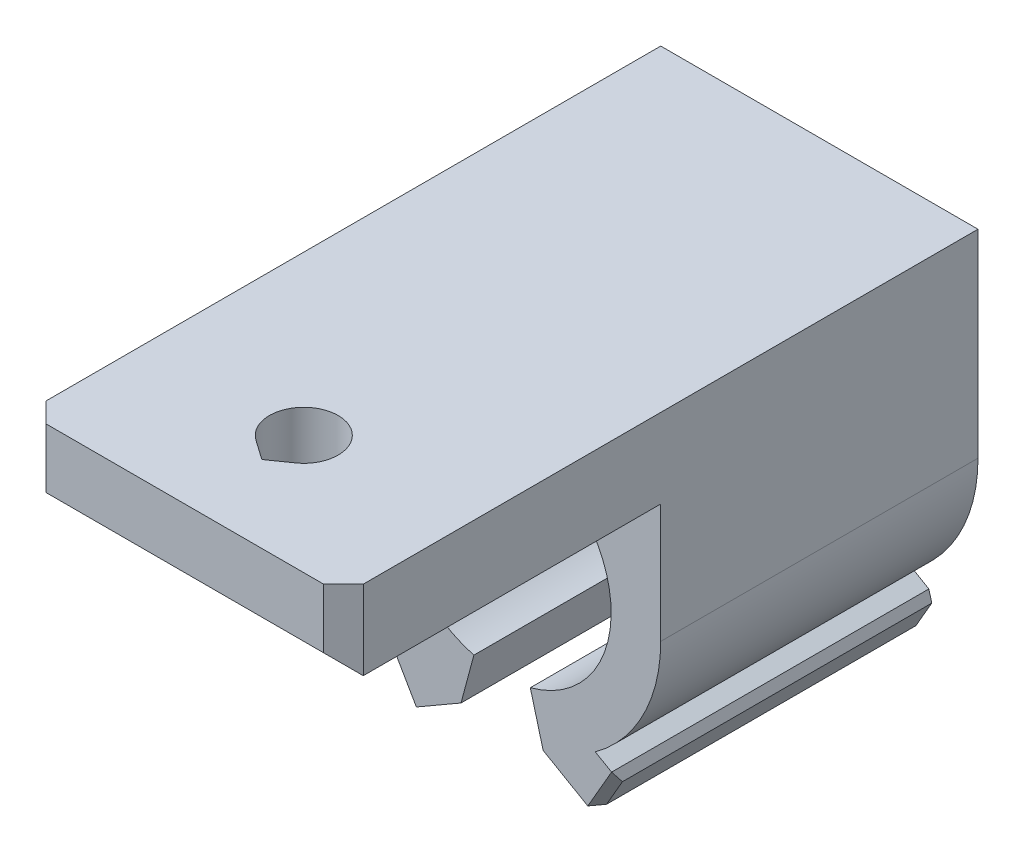
ISO-10303-21;
HEADER;
FILE_DESCRIPTION(('STEP AP214'),'2;1');
FILE_NAME('part.step','',(''),(''),'','','');
FILE_SCHEMA(('AUTOMOTIVE_DESIGN { 1 0 10303 214 1 1 1 1 }'));
ENDSEC;
DATA;
#1=APPLICATION_CONTEXT('core data for automotive mechanical design processes');
#2=APPLICATION_PROTOCOL_DEFINITION('international standard','automotive_design',2000,#1);
#3=PRODUCT_CONTEXT('',#1,'mechanical');
#4=PRODUCT('Part','Part','',(#3));
#5=PRODUCT_RELATED_PRODUCT_CATEGORY('part','',(#4));
#6=PRODUCT_DEFINITION_FORMATION('','',#4);
#7=PRODUCT_DEFINITION_CONTEXT('part definition',#1,'design');
#8=PRODUCT_DEFINITION('design','',#6,#7);
#9=PRODUCT_DEFINITION_SHAPE('','',#8);
#10=(LENGTH_UNIT() NAMED_UNIT(*) SI_UNIT(.MILLI.,.METRE.));
#11=(NAMED_UNIT(*) PLANE_ANGLE_UNIT() SI_UNIT($,.RADIAN.));
#12=(NAMED_UNIT(*) SI_UNIT($,.STERADIAN.) SOLID_ANGLE_UNIT());
#13=UNCERTAINTY_MEASURE_WITH_UNIT(LENGTH_MEASURE(1.E-05),#10,'distance_accuracy_value','');
#14=(GEOMETRIC_REPRESENTATION_CONTEXT(3) GLOBAL_UNCERTAINTY_ASSIGNED_CONTEXT((#13)) GLOBAL_UNIT_ASSIGNED_CONTEXT((#10,
#11,#12)) REPRESENTATION_CONTEXT('',''));
#15=CARTESIAN_POINT('',(0.,0.,0.));
#16=DIRECTION('',(0.,0.,1.));
#17=DIRECTION('',(1.,0.,0.));
#18=AXIS2_PLACEMENT_3D('',#15,#16,#17);
#19=CARTESIAN_POINT('',(0.,12.7,33.02));
#20=DIRECTION('',(0.,-1.,0.));
#21=DIRECTION('',(1.,0.,0.));
#22=AXIS2_PLACEMENT_3D('',#19,#20,#21);
#23=CYLINDRICAL_SURFACE('',#22,2.2);
#24=CARTESIAN_POINT('',(0.,9.01700000000003,33.02));
#25=DIRECTION('',(0.,-1.,0.));
#26=DIRECTION('',(1.,0.,0.));
#27=AXIS2_PLACEMENT_3D('',#24,#25,#26);
#28=CIRCLE('',#27,2.2);
#29=CARTESIAN_POINT('',(-1.26186815997234,9.01700000000003,34.8221344974358));
#30=VERTEX_POINT('',#29);
#31=CARTESIAN_POINT('',(1.26186815997228,9.01700000000004,34.8221344974358));
#32=VERTEX_POINT('',#31);
#33=EDGE_CURVE('E241',#30,#32,#28,.T.);
#34=ORIENTED_EDGE('',*,*,#33,.T.);
#35=DIRECTION('',(0.,-1.,0.));
#36=VECTOR('',#35,1.);
#37=CARTESIAN_POINT('',(1.26186815997227,12.7,34.8221344974358));
#38=LINE('',#37,#36);
#39=CARTESIAN_POINT('',(1.26186815997227,12.7,34.8221344974358));
#40=VERTEX_POINT('',#39);
#41=EDGE_CURVE('E252',#40,#32,#38,.T.);
#42=ORIENTED_EDGE('',*,*,#41,.F.);
#43=CARTESIAN_POINT('',(0.,12.7,33.02));
#44=DIRECTION('',(0.,-1.,0.));
#45=DIRECTION('',(1.,0.,0.));
#46=AXIS2_PLACEMENT_3D('',#43,#44,#45);
#47=CIRCLE('',#46,2.2);
#48=CARTESIAN_POINT('',(-1.26186815997235,12.7,34.8221344974358));
#49=VERTEX_POINT('',#48);
#50=EDGE_CURVE('E948',#49,#40,#47,.T.);
#51=ORIENTED_EDGE('',*,*,#50,.F.);
#52=DIRECTION('',(0.,-1.,0.));
#53=VECTOR('',#52,1.);
#54=CARTESIAN_POINT('',(-1.26186815997235,12.7,34.8221344974358));
#55=LINE('',#54,#53);
#56=EDGE_CURVE('E254',#49,#30,#55,.T.);
#57=ORIENTED_EDGE('',*,*,#56,.T.);
#58=EDGE_LOOP('',(#34,#42,#51,#57));
#59=FACE_BOUND('',#58,.T.);
#60=ADVANCED_FACE('F49',(#59),#23,.F.);
#61=CARTESIAN_POINT('',(-16.7761933291478,12.7,23.9588870637424));
#62=DIRECTION('',(0.573576436351051,0.,-0.819152044288988));
#63=DIRECTION('',(-0.819152044288988,0.,-0.573576436351051));
#64=AXIS2_PLACEMENT_3D('',#61,#62,#63);
#65=PLANE('',#64);
#66=DIRECTION('',(0.,-1.,0.));
#67=VECTOR('',#66,1.);
#68=CARTESIAN_POINT('',(0.,12.7,35.7057040952752));
#69=LINE('',#68,#67);
#70=CARTESIAN_POINT('',(0.,12.7,35.7057040952752));
#71=VERTEX_POINT('',#70);
#72=CARTESIAN_POINT('',(0.,9.01700000000003,35.7057040952752));
#73=VERTEX_POINT('',#72);
#74=EDGE_CURVE('E263',#71,#73,#69,.T.);
#75=ORIENTED_EDGE('',*,*,#74,.T.);
#76=DIRECTION('',(0.819152044288988,0.,0.573576436351051));
#77=VECTOR('',#76,1.);
#78=CARTESIAN_POINT('',(-16.7761933291478,9.01699999999998,23.9588870637424));
#79=LINE('',#78,#77);
#80=EDGE_CURVE('E243',#30,#73,#79,.T.);
#81=ORIENTED_EDGE('',*,*,#80,.F.);
#82=ORIENTED_EDGE('',*,*,#56,.F.);
#83=DIRECTION('',(0.819152044288988,0.,0.573576436351051));
#84=VECTOR('',#83,1.);
#85=CARTESIAN_POINT('',(-16.7761933291478,12.7,23.9588870637424));
#86=LINE('',#85,#84);
#87=EDGE_CURVE('E264',#49,#71,#86,.T.);
#88=ORIENTED_EDGE('',*,*,#87,.T.);
#89=EDGE_LOOP('',(#75,#81,#82,#88));
#90=FACE_BOUND('',#89,.T.);
#91=ADVANCED_FACE('F544',(#90),#65,.T.);
#92=CARTESIAN_POINT('',(16.7761933291477,12.7000000000001,23.9588870637424));
#93=DIRECTION('',(0.573576436351051,0.,0.819152044288988));
#94=DIRECTION('',(0.819152044288988,0.,-0.573576436351051));
#95=AXIS2_PLACEMENT_3D('',#92,#93,#94);
#96=PLANE('',#95);
#97=DIRECTION('',(-0.819152044288988,0.,0.573576436351051));
#98=VECTOR('',#97,1.);
#99=CARTESIAN_POINT('',(16.7761933291477,9.01700000000009,23.9588870637424));
#100=LINE('',#99,#98);
#101=EDGE_CURVE('E237',#32,#73,#100,.T.);
#102=ORIENTED_EDGE('',*,*,#101,.T.);
#103=ORIENTED_EDGE('',*,*,#74,.F.);
#104=DIRECTION('',(-0.819152044288988,0.,0.573576436351051));
#105=VECTOR('',#104,1.);
#106=CARTESIAN_POINT('',(16.7761933291477,12.7000000000001,23.9588870637424));
#107=LINE('',#106,#105);
#108=EDGE_CURVE('E260',#40,#71,#107,.T.);
#109=ORIENTED_EDGE('',*,*,#108,.F.);
#110=ORIENTED_EDGE('',*,*,#41,.T.);
#111=EDGE_LOOP('',(#102,#103,#109,#110));
#112=FACE_BOUND('',#111,.T.);
#113=ADVANCED_FACE('F258',(#112),#96,.F.);
#114=CARTESIAN_POINT('',(0.,0.,20.32));
#115=DIRECTION('',(0.,0.,1.));
#116=DIRECTION('',(1.,0.,0.));
#117=AXIS2_PLACEMENT_3D('',#114,#115,#116);
#118=PLANE('',#117);
#119=DIRECTION('',(0.866025403784447,-0.499999999999985,0.));
#120=VECTOR('',#119,1.);
#121=CARTESIAN_POINT('',(-3.59210244842757,-6.22170394666937,20.32));
#122=LINE('',#121,#120);
#123=CARTESIAN_POINT('',(2.62960149824175,-9.81380639509691,20.32));
#124=VERTEX_POINT('',#123);
#125=CARTESIAN_POINT('',(5.48921738153802,-11.4648063950969,20.32));
#126=VERTEX_POINT('',#125);
#127=EDGE_CURVE('E320',#124,#126,#122,.T.);
#128=ORIENTED_EDGE('',*,*,#127,.T.);
#129=DIRECTION('',(0.49999999999999,0.866025403784444,0.));
#130=VECTOR('',#129,1.);
#131=CARTESIAN_POINT('',(7.01321738153799,-8.82516096436189,20.32));
#132=LINE('',#131,#130);
#133=CARTESIAN_POINT('',(7.01321738153799,-8.82516096436189,20.32));
#134=VERTEX_POINT('',#133);
#135=EDGE_CURVE('E475',#126,#134,#132,.T.);
#136=ORIENTED_EDGE('',*,*,#135,.T.);
#137=DIRECTION('',(-0.866025403784444,0.499999999999991,0.));
#138=VECTOR('',#137,1.);
#139=CARTESIAN_POINT('',(-2.06810244842761,-3.5820585159343,20.32));
#140=LINE('',#139,#138);
#141=CARTESIAN_POINT('',(5.96856706004567,-8.22203182003927,20.32));
#142=VERTEX_POINT('',#141);
#143=EDGE_CURVE('E324',#134,#142,#140,.T.);
#144=ORIENTED_EDGE('',*,*,#143,.T.);
#145=CARTESIAN_POINT('',(0.,0.,20.32));
#146=DIRECTION('',(0.,0.,1.));
#147=DIRECTION('',(1.,0.,0.));
#148=AXIS2_PLACEMENT_3D('',#145,#146,#147);
#149=CIRCLE('',#148,10.16);
#150=CARTESIAN_POINT('',(10.16,0.,20.32));
#151=VERTEX_POINT('',#150);
#152=EDGE_CURVE('E288',#142,#151,#149,.T.);
#153=ORIENTED_EDGE('',*,*,#152,.T.);
#154=DIRECTION('',(0.,1.,0.));
#155=VECTOR('',#154,1.);
#156=CARTESIAN_POINT('',(10.16,0.,20.32));
#157=LINE('',#156,#155);
#158=CARTESIAN_POINT('',(10.16,7.62000000000007,20.32));
#159=VERTEX_POINT('',#158);
#160=EDGE_CURVE('E292',#151,#159,#157,.T.);
#161=ORIENTED_EDGE('',*,*,#160,.T.);
#162=DIRECTION('',(-1.,0.,0.));
#163=VECTOR('',#162,1.);
#164=CARTESIAN_POINT('',(0.,7.62000000000003,20.32));
#165=LINE('',#164,#163);
#166=CARTESIAN_POINT('',(-10.16,7.62,20.32));
#167=VERTEX_POINT('',#166);
#168=EDGE_CURVE('E283',#159,#167,#165,.T.);
#169=ORIENTED_EDGE('',*,*,#168,.T.);
#170=DIRECTION('',(0.,1.,0.));
#171=VECTOR('',#170,1.);
#172=CARTESIAN_POINT('',(-10.16,0.,20.32));
#173=LINE('',#172,#171);
#174=CARTESIAN_POINT('',(-10.16,0.,20.32));
#175=VERTEX_POINT('',#174);
#176=EDGE_CURVE('E298',#175,#167,#173,.T.);
#177=ORIENTED_EDGE('',*,*,#176,.F.);
#178=CARTESIAN_POINT('',(-5.96856706004555,-8.22203182003933,20.32));
#179=VERTEX_POINT('',#178);
#180=EDGE_CURVE('E294',#175,#179,#149,.T.);
#181=ORIENTED_EDGE('',*,*,#180,.T.);
#182=DIRECTION('',(0.866025403784441,0.499999999999996,0.));
#183=VECTOR('',#182,1.);
#184=CARTESIAN_POINT('',(2.06810244842765,-3.58205851593433,20.32));
#185=LINE('',#184,#183);
#186=CARTESIAN_POINT('',(-7.01321738153785,-8.82516096436193,20.32));
#187=VERTEX_POINT('',#186);
#188=EDGE_CURVE('E302',#187,#179,#185,.T.);
#189=ORIENTED_EDGE('',*,*,#188,.F.);
#190=DIRECTION('',(0.499999999999995,-0.866025403784441,0.));
#191=VECTOR('',#190,1.);
#192=CARTESIAN_POINT('',(-9.0813198299655,-5.2431024484276,20.32));
#193=LINE('',#192,#191);
#194=CARTESIAN_POINT('',(-5.48921738153787,-11.4648063950969,20.32));
#195=VERTEX_POINT('',#194);
#196=EDGE_CURVE('E472',#187,#195,#193,.T.);
#197=ORIENTED_EDGE('',*,*,#196,.T.);
#198=DIRECTION('',(-0.866025403784441,-0.499999999999996,0.));
#199=VECTOR('',#198,1.);
#200=CARTESIAN_POINT('',(3.59210244842764,-6.22170394666929,20.32));
#201=LINE('',#200,#199);
#202=CARTESIAN_POINT('',(-2.62960149824165,-9.81380639509693,20.32));
#203=VERTEX_POINT('',#202);
#204=EDGE_CURVE('E305',#203,#195,#201,.T.);
#205=ORIENTED_EDGE('',*,*,#204,.F.);
#206=DIRECTION('',(-0.258819045102524,-0.965925826289067,0.));
#207=VECTOR('',#206,1.);
#208=CARTESIAN_POINT('',(0.,0.,20.32));
#209=LINE('',#208,#207);
#210=CARTESIAN_POINT('',(-1.80785103004113,-6.74699189662914,20.32));
#211=VERTEX_POINT('',#210);
#212=EDGE_CURVE('E309',#211,#203,#209,.T.);
#213=ORIENTED_EDGE('',*,*,#212,.F.);
#214=CARTESIAN_POINT('',(0.,0.,20.32));
#215=DIRECTION('',(0.,0.,1.));
#216=DIRECTION('',(1.,0.,0.));
#217=AXIS2_PLACEMENT_3D('',#214,#215,#216);
#218=CIRCLE('',#217,6.985);
#219=CARTESIAN_POINT('',(1.8078510300412,-6.74699189662912,20.32));
#220=VERTEX_POINT('',#219);
#221=EDGE_CURVE('E313',#220,#211,#218,.T.);
#222=ORIENTED_EDGE('',*,*,#221,.F.);
#223=DIRECTION('',(0.258819045102534,-0.965925826289065,0.));
#224=VECTOR('',#223,1.);
#225=CARTESIAN_POINT('',(0.,0.,20.32));
#226=LINE('',#225,#224);
#227=EDGE_CURVE('E317',#220,#124,#226,.T.);
#228=ORIENTED_EDGE('',*,*,#227,.T.);
#229=EDGE_LOOP('',(#128,#136,#144,#153,#161,#169,#177,#181,#189,#197,#205,#213,#222,#228));
#230=FACE_BOUND('',#229,.T.);
#231=ADVANCED_FACE('F521',(#230),#118,.T.);
#232=CARTESIAN_POINT('',(0.,0.,20.32));
#233=DIRECTION('',(0.,0.,-1.));
#234=DIRECTION('',(-1.,0.,0.));
#235=AXIS2_PLACEMENT_3D('',#232,#233,#234);
#236=CYLINDRICAL_SURFACE('',#235,10.16);
#237=CARTESIAN_POINT('',(0.,0.,0.));
#238=DIRECTION('',(0.,0.,1.));
#239=DIRECTION('',(1.,0.,0.));
#240=AXIS2_PLACEMENT_3D('',#237,#238,#239);
#241=CIRCLE('',#240,10.16);
#242=CARTESIAN_POINT('',(5.96856706004567,-8.22203182003927,0.));
#243=VERTEX_POINT('',#242);
#244=CARTESIAN_POINT('',(10.16,0.,0.));
#245=VERTEX_POINT('',#244);
#246=EDGE_CURVE('E287',#243,#245,#241,.T.);
#247=ORIENTED_EDGE('',*,*,#246,.T.);
#248=DIRECTION('',(0.,0.,-1.));
#249=VECTOR('',#248,1.);
#250=CARTESIAN_POINT('',(10.16,0.,20.32));
#251=LINE('',#250,#249);
#252=EDGE_CURVE('E405',#151,#245,#251,.T.);
#253=ORIENTED_EDGE('',*,*,#252,.F.);
#254=ORIENTED_EDGE('',*,*,#152,.F.);
#255=DIRECTION('',(0.,0.,-1.));
#256=VECTOR('',#255,1.);
#257=CARTESIAN_POINT('',(5.96856706004567,-8.22203182003927,20.32));
#258=LINE('',#257,#256);
#259=EDGE_CURVE('E327',#142,#243,#258,.T.);
#260=ORIENTED_EDGE('',*,*,#259,.T.);
#261=EDGE_LOOP('',(#247,#253,#254,#260));
#262=FACE_BOUND('',#261,.T.);
#263=ADVANCED_FACE('F565',(#262),#236,.T.);
#264=CARTESIAN_POINT('',(10.16,0.,20.32));
#265=DIRECTION('',(-1.,0.,0.));
#266=DIRECTION('',(0.,-1.,0.));
#267=AXIS2_PLACEMENT_3D('',#264,#265,#266);
#268=PLANE('',#267);
#269=DIRECTION('',(0.,0.,-1.));
#270=VECTOR('',#269,1.);
#271=CARTESIAN_POINT('',(10.16,12.7,20.32));
#272=LINE('',#271,#270);
#273=CARTESIAN_POINT('',(10.16,12.7,39.37));
#274=VERTEX_POINT('',#273);
#275=CARTESIAN_POINT('',(10.16,12.7,0.));
#276=VERTEX_POINT('',#275);
#277=EDGE_CURVE('E402',#274,#276,#272,.T.);
#278=ORIENTED_EDGE('',*,*,#277,.F.);
#279=DIRECTION('',(0.,-1.,0.));
#280=VECTOR('',#279,1.);
#281=CARTESIAN_POINT('',(10.16,7.62000000000007,39.37));
#282=LINE('',#281,#280);
#283=CARTESIAN_POINT('',(10.16,7.62000000000007,39.37));
#284=VERTEX_POINT('',#283);
#285=EDGE_CURVE('E425',#274,#284,#282,.T.);
#286=ORIENTED_EDGE('',*,*,#285,.T.);
#287=DIRECTION('',(0.,0.,-1.));
#288=VECTOR('',#287,1.);
#289=CARTESIAN_POINT('',(10.16,7.62000000000007,40.64));
#290=LINE('',#289,#288);
#291=EDGE_CURVE('E277',#284,#159,#290,.T.);
#292=ORIENTED_EDGE('',*,*,#291,.T.);
#293=ORIENTED_EDGE('',*,*,#160,.F.);
#294=ORIENTED_EDGE('',*,*,#252,.T.);
#295=DIRECTION('',(0.,1.,0.));
#296=VECTOR('',#295,1.);
#297=CARTESIAN_POINT('',(10.16,0.,0.));
#298=LINE('',#297,#296);
#299=EDGE_CURVE('E331',#245,#276,#298,.T.);
#300=ORIENTED_EDGE('',*,*,#299,.T.);
#301=EDGE_LOOP('',(#278,#286,#292,#293,#294,#300));
#302=FACE_BOUND('',#301,.T.);
#303=ADVANCED_FACE('F677',(#302),#268,.F.);
#304=CARTESIAN_POINT('',(0.,12.7,20.32));
#305=DIRECTION('',(0.,1.,0.));
#306=DIRECTION('',(-1.,0.,0.));
#307=AXIS2_PLACEMENT_3D('',#304,#305,#306);
#308=PLANE('',#307);
#309=ORIENTED_EDGE('',*,*,#50,.T.);
#310=ORIENTED_EDGE('',*,*,#108,.T.);
#311=ORIENTED_EDGE('',*,*,#87,.F.);
#312=EDGE_LOOP('',(#309,#310,#311));
#313=FACE_BOUND('',#312,.T.);
#314=DIRECTION('',(1.,0.,0.));
#315=VECTOR('',#314,1.);
#316=CARTESIAN_POINT('',(0.,12.7,40.64));
#317=LINE('',#316,#315);
#318=CARTESIAN_POINT('',(-8.88999999999998,12.7,40.64));
#319=VERTEX_POINT('',#318);
#320=CARTESIAN_POINT('',(8.88999999999998,12.7,40.64));
#321=VERTEX_POINT('',#320);
#322=EDGE_CURVE('E273',#319,#321,#317,.T.);
#323=ORIENTED_EDGE('',*,*,#322,.T.);
#324=DIRECTION('',(0.707106781186549,0.,-0.707106781186546));
#325=VECTOR('',#324,1.);
#326=CARTESIAN_POINT('',(14.605,12.7,34.9250000000001));
#327=LINE('',#326,#325);
#328=EDGE_CURVE('E422',#321,#274,#327,.T.);
#329=ORIENTED_EDGE('',*,*,#328,.T.);
#330=ORIENTED_EDGE('',*,*,#277,.T.);
#331=DIRECTION('',(1.,0.,0.));
#332=VECTOR('',#331,1.);
#333=CARTESIAN_POINT('',(0.,12.7,0.));
#334=LINE('',#333,#332);
#335=CARTESIAN_POINT('',(-10.16,12.7,0.));
#336=VERTEX_POINT('',#335);
#337=EDGE_CURVE('E336',#336,#276,#334,.T.);
#338=ORIENTED_EDGE('',*,*,#337,.F.);
#339=DIRECTION('',(0.,0.,-1.));
#340=VECTOR('',#339,1.);
#341=CARTESIAN_POINT('',(-10.16,12.7,20.32));
#342=LINE('',#341,#340);
#343=CARTESIAN_POINT('',(-10.16,12.7,39.37));
#344=VERTEX_POINT('',#343);
#345=EDGE_CURVE('E399',#344,#336,#342,.T.);
#346=ORIENTED_EDGE('',*,*,#345,.F.);
#347=DIRECTION('',(-0.707106781186549,0.,-0.707106781186546));
#348=VECTOR('',#347,1.);
#349=CARTESIAN_POINT('',(-14.605,12.7,34.925));
#350=LINE('',#349,#348);
#351=EDGE_CURVE('E419',#344,#319,#350,.F.);
#352=ORIENTED_EDGE('',*,*,#351,.T.);
#353=EDGE_LOOP('',(#323,#329,#330,#338,#346,#352));
#354=FACE_BOUND('',#353,.T.);
#355=ADVANCED_FACE('F683',(#313,#354),#308,.T.);
#356=CARTESIAN_POINT('',(-10.16,0.,20.32));
#357=DIRECTION('',(-1.,0.,0.));
#358=DIRECTION('',(0.,-1.,0.));
#359=AXIS2_PLACEMENT_3D('',#356,#357,#358);
#360=PLANE('',#359);
#361=DIRECTION('',(0.,0.,-1.));
#362=VECTOR('',#361,1.);
#363=CARTESIAN_POINT('',(-10.16,7.62,40.64));
#364=LINE('',#363,#362);
#365=CARTESIAN_POINT('',(-10.16,7.62,39.37));
#366=VERTEX_POINT('',#365);
#367=EDGE_CURVE('E280',#366,#167,#364,.T.);
#368=ORIENTED_EDGE('',*,*,#367,.F.);
#369=DIRECTION('',(0.,1.,0.));
#370=VECTOR('',#369,1.);
#371=CARTESIAN_POINT('',(-10.16,0.,39.37));
#372=LINE('',#371,#370);
#373=EDGE_CURVE('E431',#366,#344,#372,.T.);
#374=ORIENTED_EDGE('',*,*,#373,.T.);
#375=ORIENTED_EDGE('',*,*,#345,.T.);
#376=DIRECTION('',(0.,1.,0.));
#377=VECTOR('',#376,1.);
#378=CARTESIAN_POINT('',(-10.16,0.,0.));
#379=LINE('',#378,#377);
#380=CARTESIAN_POINT('',(-10.16,0.,0.));
#381=VERTEX_POINT('',#380);
#382=EDGE_CURVE('E340',#381,#336,#379,.T.);
#383=ORIENTED_EDGE('',*,*,#382,.F.);
#384=DIRECTION('',(0.,0.,-1.));
#385=VECTOR('',#384,1.);
#386=CARTESIAN_POINT('',(-10.16,0.,20.32));
#387=LINE('',#386,#385);
#388=EDGE_CURVE('E396',#175,#381,#387,.T.);
#389=ORIENTED_EDGE('',*,*,#388,.F.);
#390=ORIENTED_EDGE('',*,*,#176,.T.);
#391=EDGE_LOOP('',(#368,#374,#375,#383,#389,#390));
#392=FACE_BOUND('',#391,.T.);
#393=ADVANCED_FACE('F700',(#392),#360,.T.);
#394=CARTESIAN_POINT('',(-5.96856706004555,-8.22203182003933,0.));
#395=VERTEX_POINT('',#394);
#396=EDGE_CURVE('E332',#381,#395,#241,.T.);
#397=ORIENTED_EDGE('',*,*,#396,.T.);
#398=DIRECTION('',(0.,0.,-1.));
#399=VECTOR('',#398,1.);
#400=CARTESIAN_POINT('',(-5.96856706004555,-8.22203182003933,20.32));
#401=LINE('',#400,#399);
#402=EDGE_CURVE('E392',#179,#395,#401,.T.);
#403=ORIENTED_EDGE('',*,*,#402,.F.);
#404=ORIENTED_EDGE('',*,*,#180,.F.);
#405=ORIENTED_EDGE('',*,*,#388,.T.);
#406=EDGE_LOOP('',(#397,#403,#404,#405));
#407=FACE_BOUND('',#406,.T.);
#408=ADVANCED_FACE('F541',(#407),#236,.T.);
#409=CARTESIAN_POINT('',(2.06810244842765,-3.58205851593433,20.32));
#410=DIRECTION('',(-0.499999999999996,0.866025403784441,0.));
#411=DIRECTION('',(-0.866025403784441,-0.499999999999996,0.));
#412=AXIS2_PLACEMENT_3D('',#409,#410,#411);
#413=PLANE('',#412);
#414=DIRECTION('',(0.866025403784441,0.499999999999996,0.));
#415=VECTOR('',#414,1.);
#416=CARTESIAN_POINT('',(2.06810244842765,-3.58205851593433,0.));
#417=LINE('',#416,#415);
#418=CARTESIAN_POINT('',(-7.01321738153785,-8.82516096436193,0.));
#419=VERTEX_POINT('',#418);
#420=EDGE_CURVE('E344',#419,#395,#417,.T.);
#421=ORIENTED_EDGE('',*,*,#420,.F.);
#422=DIRECTION('',(0.,0.,1.));
#423=VECTOR('',#422,1.);
#424=CARTESIAN_POINT('',(-7.01321738153785,-8.82516096436193,20.32));
#425=LINE('',#424,#423);
#426=EDGE_CURVE('E60',#419,#187,#425,.T.);
#427=ORIENTED_EDGE('',*,*,#426,.T.);
#428=ORIENTED_EDGE('',*,*,#188,.T.);
#429=ORIENTED_EDGE('',*,*,#402,.T.);
#430=EDGE_LOOP('',(#421,#427,#428,#429));
#431=FACE_BOUND('',#430,.T.);
#432=ADVANCED_FACE('F530',(#431),#413,.T.);
#433=CARTESIAN_POINT('',(-9.52126073508801,-5.4971024484276,20.32));
#434=DIRECTION('',(-0.866025403784441,-0.499999999999995,0.));
#435=DIRECTION('',(0.499999999999995,-0.866025403784441,0.));
#436=AXIS2_PLACEMENT_3D('',#433,#434,#435);
#437=PLANE('',#436);
#438=DIRECTION('',(-0.499999999999995,0.866025403784441,0.));
#439=VECTOR('',#438,1.);
#440=CARTESIAN_POINT('',(-9.52126073508801,-5.4971024484276,19.812));
#441=LINE('',#440,#439);
#442=CARTESIAN_POINT('',(-6.18315828666037,-11.2788654899744,19.812));
#443=VERTEX_POINT('',#442);
#444=CARTESIAN_POINT('',(-7.19915828666036,-9.51910186948443,19.812));
#445=VERTEX_POINT('',#444);
#446=EDGE_CURVE('E68',#443,#445,#441,.T.);
#447=ORIENTED_EDGE('',*,*,#446,.T.);
#448=DIRECTION('',(0.,0.,-1.));
#449=VECTOR('',#448,1.);
#450=CARTESIAN_POINT('',(-7.19915828666036,-9.51910186948443,20.32));
#451=LINE('',#450,#449);
#452=CARTESIAN_POINT('',(-7.19915828666036,-9.51910186948443,0.));
#453=VERTEX_POINT('',#452);
#454=EDGE_CURVE('E482',#445,#453,#451,.T.);
#455=ORIENTED_EDGE('',*,*,#454,.T.);
#456=DIRECTION('',(-0.499999999999995,0.866025403784442,0.));
#457=VECTOR('',#456,1.);
#458=CARTESIAN_POINT('',(-9.52126073508801,-5.4971024484276,0.));
#459=LINE('',#458,#457);
#460=CARTESIAN_POINT('',(-6.18315828666037,-11.2788654899744,0.));
#461=VERTEX_POINT('',#460);
#462=EDGE_CURVE('E347',#461,#453,#459,.T.);
#463=ORIENTED_EDGE('',*,*,#462,.F.);
#464=DIRECTION('',(0.,0.,1.));
#465=VECTOR('',#464,1.);
#466=CARTESIAN_POINT('',(-6.18315828666037,-11.2788654899744,20.32));
#467=LINE('',#466,#465);
#468=EDGE_CURVE('E73',#461,#443,#467,.T.);
#469=ORIENTED_EDGE('',*,*,#468,.T.);
#470=EDGE_LOOP('',(#447,#455,#463,#469));
#471=FACE_BOUND('',#470,.T.);
#472=ADVANCED_FACE('F533',(#471),#437,.T.);
#473=CARTESIAN_POINT('',(3.59210244842764,-6.22170394666929,20.32));
#474=DIRECTION('',(0.499999999999996,-0.866025403784441,0.));
#475=DIRECTION('',(0.866025403784441,0.499999999999996,0.));
#476=AXIS2_PLACEMENT_3D('',#473,#474,#475);
#477=PLANE('',#476);
#478=ORIENTED_EDGE('',*,*,#204,.T.);
#479=DIRECTION('',(0.,0.,-1.));
#480=VECTOR('',#479,1.);
#481=CARTESIAN_POINT('',(-5.48921738153787,-11.4648063950969,20.32));
#482=LINE('',#481,#480);
#483=CARTESIAN_POINT('',(-5.48921738153787,-11.4648063950969,0.));
#484=VERTEX_POINT('',#483);
#485=EDGE_CURVE('E11',#195,#484,#482,.T.);
#486=ORIENTED_EDGE('',*,*,#485,.T.);
#487=DIRECTION('',(-0.866025403784441,-0.499999999999996,0.));
#488=VECTOR('',#487,1.);
#489=CARTESIAN_POINT('',(3.59210244842764,-6.22170394666929,0.));
#490=LINE('',#489,#488);
#491=CARTESIAN_POINT('',(-2.62960149824165,-9.81380639509693,0.));
#492=VERTEX_POINT('',#491);
#493=EDGE_CURVE('E351',#492,#484,#490,.T.);
#494=ORIENTED_EDGE('',*,*,#493,.F.);
#495=DIRECTION('',(0.,0.,-1.));
#496=VECTOR('',#495,1.);
#497=CARTESIAN_POINT('',(-2.62960149824165,-9.81380639509693,20.32));
#498=LINE('',#497,#496);
#499=EDGE_CURVE('E389',#203,#492,#498,.T.);
#500=ORIENTED_EDGE('',*,*,#499,.F.);
#501=EDGE_LOOP('',(#478,#486,#494,#500));
#502=FACE_BOUND('',#501,.T.);
#503=ADVANCED_FACE('F509',(#502),#477,.T.);
#504=CARTESIAN_POINT('',(0.,0.,20.32));
#505=DIRECTION('',(0.965925826289067,-0.258819045102524,0.));
#506=DIRECTION('',(0.258819045102524,0.965925826289067,0.));
#507=AXIS2_PLACEMENT_3D('',#504,#505,#506);
#508=PLANE('',#507);
#509=DIRECTION('',(-0.258819045102524,-0.965925826289067,0.));
#510=VECTOR('',#509,1.);
#511=CARTESIAN_POINT('',(0.,0.,0.));
#512=LINE('',#511,#510);
#513=CARTESIAN_POINT('',(-1.80785103004113,-6.74699189662914,0.));
#514=VERTEX_POINT('',#513);
#515=EDGE_CURVE('E355',#514,#492,#512,.T.);
#516=ORIENTED_EDGE('',*,*,#515,.F.);
#517=DIRECTION('',(0.,0.,-1.));
#518=VECTOR('',#517,1.);
#519=CARTESIAN_POINT('',(-1.80785103004113,-6.74699189662914,20.32));
#520=LINE('',#519,#518);
#521=EDGE_CURVE('E386',#211,#514,#520,.T.);
#522=ORIENTED_EDGE('',*,*,#521,.F.);
#523=ORIENTED_EDGE('',*,*,#212,.T.);
#524=ORIENTED_EDGE('',*,*,#499,.T.);
#525=EDGE_LOOP('',(#516,#522,#523,#524));
#526=FACE_BOUND('',#525,.T.);
#527=ADVANCED_FACE('F518',(#526),#508,.T.);
#528=CARTESIAN_POINT('',(0.,0.,20.32));
#529=DIRECTION('',(0.,0.,-1.));
#530=DIRECTION('',(-1.,0.,0.));
#531=AXIS2_PLACEMENT_3D('',#528,#529,#530);
#532=CYLINDRICAL_SURFACE('',#531,6.985);
#533=CARTESIAN_POINT('',(0.,0.,0.));
#534=DIRECTION('',(0.,0.,1.));
#535=DIRECTION('',(1.,0.,0.));
#536=AXIS2_PLACEMENT_3D('',#533,#534,#535);
#537=CIRCLE('',#536,6.985);
#538=CARTESIAN_POINT('',(1.8078510300412,-6.74699189662912,0.));
#539=VERTEX_POINT('',#538);
#540=EDGE_CURVE('E359',#539,#514,#537,.T.);
#541=ORIENTED_EDGE('',*,*,#540,.F.);
#542=DIRECTION('',(0.,0.,-1.));
#543=VECTOR('',#542,1.);
#544=CARTESIAN_POINT('',(1.8078510300412,-6.74699189662912,20.32));
#545=LINE('',#544,#543);
#546=EDGE_CURVE('E383',#220,#539,#545,.T.);
#547=ORIENTED_EDGE('',*,*,#546,.F.);
#548=ORIENTED_EDGE('',*,*,#221,.T.);
#549=ORIENTED_EDGE('',*,*,#521,.T.);
#550=EDGE_LOOP('',(#541,#547,#548,#549));
#551=FACE_BOUND('',#550,.T.);
#552=ADVANCED_FACE('F582',(#551),#532,.F.);
#553=CARTESIAN_POINT('',(0.,0.,20.32));
#554=DIRECTION('',(0.965925826289065,0.258819045102534,0.));
#555=DIRECTION('',(-0.258819045102534,0.965925826289065,0.));
#556=AXIS2_PLACEMENT_3D('',#553,#554,#555);
#557=PLANE('',#556);
#558=DIRECTION('',(0.258819045102534,-0.965925826289065,0.));
#559=VECTOR('',#558,1.);
#560=CARTESIAN_POINT('',(0.,0.,0.));
#561=LINE('',#560,#559);
#562=CARTESIAN_POINT('',(2.62960149824175,-9.81380639509691,0.));
#563=VERTEX_POINT('',#562);
#564=EDGE_CURVE('E363',#539,#563,#561,.T.);
#565=ORIENTED_EDGE('',*,*,#564,.T.);
#566=DIRECTION('',(0.,0.,-1.));
#567=VECTOR('',#566,1.);
#568=CARTESIAN_POINT('',(2.62960149824175,-9.81380639509691,20.32));
#569=LINE('',#568,#567);
#570=EDGE_CURVE('E379',#124,#563,#569,.T.);
#571=ORIENTED_EDGE('',*,*,#570,.F.);
#572=ORIENTED_EDGE('',*,*,#227,.F.);
#573=ORIENTED_EDGE('',*,*,#546,.T.);
#574=EDGE_LOOP('',(#565,#571,#572,#573));
#575=FACE_BOUND('',#574,.T.);
#576=ADVANCED_FACE('F579',(#575),#557,.F.);
#577=CARTESIAN_POINT('',(-3.59210244842757,-6.22170394666937,20.32));
#578=DIRECTION('',(0.499999999999985,0.866025403784447,0.));
#579=DIRECTION('',(-0.866025403784448,0.499999999999985,0.));
#580=AXIS2_PLACEMENT_3D('',#577,#578,#579);
#581=PLANE('',#580);
#582=DIRECTION('',(0.866025403784447,-0.499999999999985,0.));
#583=VECTOR('',#582,1.);
#584=CARTESIAN_POINT('',(-3.59210244842757,-6.22170394666937,0.));
#585=LINE('',#584,#583);
#586=CARTESIAN_POINT('',(5.48921738153802,-11.4648063950969,0.));
#587=VERTEX_POINT('',#586);
#588=EDGE_CURVE('E366',#563,#587,#585,.T.);
#589=ORIENTED_EDGE('',*,*,#588,.T.);
#590=DIRECTION('',(0.,0.,1.));
#591=VECTOR('',#590,1.);
#592=CARTESIAN_POINT('',(5.48921738153802,-11.4648063950969,20.32));
#593=LINE('',#592,#591);
#594=EDGE_CURVE('E469',#587,#126,#593,.T.);
#595=ORIENTED_EDGE('',*,*,#594,.T.);
#596=ORIENTED_EDGE('',*,*,#127,.F.);
#597=ORIENTED_EDGE('',*,*,#570,.T.);
#598=EDGE_LOOP('',(#589,#595,#596,#597));
#599=FACE_BOUND('',#598,.T.);
#600=ADVANCED_FACE('F575',(#599),#581,.F.);
#601=CARTESIAN_POINT('',(9.5212607350881,-5.49710244842758,20.32));
#602=DIRECTION('',(-0.866025403784444,0.49999999999999,0.));
#603=DIRECTION('',(-0.49999999999999,-0.866025403784444,0.));
#604=AXIS2_PLACEMENT_3D('',#601,#602,#603);
#605=PLANE('',#604);
#606=DIRECTION('',(0.49999999999999,0.866025403784444,0.));
#607=VECTOR('',#606,1.);
#608=CARTESIAN_POINT('',(9.5212607350881,-5.49710244842758,0.));
#609=LINE('',#608,#607);
#610=CARTESIAN_POINT('',(6.18315828666052,-11.2788654899744,0.));
#611=VERTEX_POINT('',#610);
#612=CARTESIAN_POINT('',(7.19915828666049,-9.51910186948439,0.));
#613=VERTEX_POINT('',#612);
#614=EDGE_CURVE('E370',#611,#613,#609,.T.);
#615=ORIENTED_EDGE('',*,*,#614,.T.);
#616=DIRECTION('',(0.,0.,1.));
#617=VECTOR('',#616,1.);
#618=CARTESIAN_POINT('',(7.19915828666049,-9.51910186948439,20.32));
#619=LINE('',#618,#617);
#620=CARTESIAN_POINT('',(7.19915828666049,-9.51910186948439,19.812));
#621=VERTEX_POINT('',#620);
#622=EDGE_CURVE('E466',#613,#621,#619,.T.);
#623=ORIENTED_EDGE('',*,*,#622,.T.);
#624=DIRECTION('',(-0.49999999999999,-0.866025403784444,0.));
#625=VECTOR('',#624,1.);
#626=CARTESIAN_POINT('',(5.92915828666052,-11.7188063950969,19.812));
#627=LINE('',#626,#625);
#628=CARTESIAN_POINT('',(6.18315828666052,-11.2788654899744,19.812));
#629=VERTEX_POINT('',#628);
#630=EDGE_CURVE('E460',#621,#629,#627,.T.);
#631=ORIENTED_EDGE('',*,*,#630,.T.);
#632=DIRECTION('',(0.,0.,-1.));
#633=VECTOR('',#632,1.);
#634=CARTESIAN_POINT('',(6.18315828666052,-11.2788654899744,20.32));
#635=LINE('',#634,#633);
#636=EDGE_CURVE('E463',#629,#611,#635,.T.);
#637=ORIENTED_EDGE('',*,*,#636,.T.);
#638=EDGE_LOOP('',(#615,#623,#631,#637));
#639=FACE_BOUND('',#638,.T.);
#640=ADVANCED_FACE('F571',(#639),#605,.F.);
#641=CARTESIAN_POINT('',(-2.06810244842761,-3.5820585159343,20.32));
#642=DIRECTION('',(-0.499999999999991,-0.866025403784444,0.));
#643=DIRECTION('',(0.866025403784444,-0.499999999999991,0.));
#644=AXIS2_PLACEMENT_3D('',#641,#642,#643);
#645=PLANE('',#644);
#646=ORIENTED_EDGE('',*,*,#143,.F.);
#647=DIRECTION('',(0.,0.,-1.));
#648=VECTOR('',#647,1.);
#649=CARTESIAN_POINT('',(7.01321738153799,-8.82516096436189,20.32));
#650=LINE('',#649,#648);
#651=CARTESIAN_POINT('',(7.01321738153799,-8.82516096436189,0.));
#652=VERTEX_POINT('',#651);
#653=EDGE_CURVE('E434',#134,#652,#650,.T.);
#654=ORIENTED_EDGE('',*,*,#653,.T.);
#655=DIRECTION('',(-0.866025403784444,0.499999999999991,0.));
#656=VECTOR('',#655,1.);
#657=CARTESIAN_POINT('',(-2.06810244842761,-3.5820585159343,0.));
#658=LINE('',#657,#656);
#659=EDGE_CURVE('E293',#652,#243,#658,.T.);
#660=ORIENTED_EDGE('',*,*,#659,.T.);
#661=ORIENTED_EDGE('',*,*,#259,.F.);
#662=EDGE_LOOP('',(#646,#654,#660,#661));
#663=FACE_BOUND('',#662,.T.);
#664=ADVANCED_FACE('F568',(#663),#645,.F.);
#665=CARTESIAN_POINT('',(0.,0.,0.));
#666=DIRECTION('',(0.,0.,1.));
#667=DIRECTION('',(1.,0.,0.));
#668=AXIS2_PLACEMENT_3D('',#665,#666,#667);
#669=PLANE('',#668);
#670=ORIENTED_EDGE('',*,*,#659,.F.);
#671=DIRECTION('',(-0.258819045102527,0.965925826289067,0.));
#672=VECTOR('',#671,1.);
#673=CARTESIAN_POINT('',(7.01321738153799,-8.82516096436189,0.));
#674=LINE('',#673,#672);
#675=EDGE_CURVE('E457',#652,#613,#674,.F.);
#676=ORIENTED_EDGE('',*,*,#675,.T.);
#677=ORIENTED_EDGE('',*,*,#614,.F.);
#678=DIRECTION('',(0.965925826289063,0.25881904510254,0.));
#679=VECTOR('',#678,1.);
#680=CARTESIAN_POINT('',(6.18315828666052,-11.2788654899744,0.));
#681=LINE('',#680,#679);
#682=EDGE_CURVE('E454',#611,#587,#681,.F.);
#683=ORIENTED_EDGE('',*,*,#682,.T.);
#684=ORIENTED_EDGE('',*,*,#588,.F.);
#685=ORIENTED_EDGE('',*,*,#564,.F.);
#686=ORIENTED_EDGE('',*,*,#540,.T.);
#687=ORIENTED_EDGE('',*,*,#515,.T.);
#688=ORIENTED_EDGE('',*,*,#493,.T.);
#689=DIRECTION('',(0.965925826289069,-0.258819045102519,0.));
#690=VECTOR('',#689,1.);
#691=CARTESIAN_POINT('',(-5.48921738153787,-11.4648063950969,0.));
#692=LINE('',#691,#690);
#693=EDGE_CURVE('E448',#484,#461,#692,.F.);
#694=ORIENTED_EDGE('',*,*,#693,.T.);
#695=ORIENTED_EDGE('',*,*,#462,.T.);
#696=DIRECTION('',(-0.258819045102536,-0.965925826289064,0.));
#697=VECTOR('',#696,1.);
#698=CARTESIAN_POINT('',(-7.19915828666036,-9.51910186948443,0.));
#699=LINE('',#698,#697);
#700=EDGE_CURVE('E451',#453,#419,#699,.F.);
#701=ORIENTED_EDGE('',*,*,#700,.T.);
#702=ORIENTED_EDGE('',*,*,#420,.T.);
#703=ORIENTED_EDGE('',*,*,#396,.F.);
#704=ORIENTED_EDGE('',*,*,#382,.T.);
#705=ORIENTED_EDGE('',*,*,#337,.T.);
#706=ORIENTED_EDGE('',*,*,#299,.F.);
#707=ORIENTED_EDGE('',*,*,#246,.F.);
#708=EDGE_LOOP('',(#670,#676,#677,#683,#684,#685,#686,#687,#688,#694,#695,#701,#702,#703,#704,
#705,#706,#707));
#709=FACE_BOUND('',#708,.T.);
#710=ADVANCED_FACE('F513',(#709),#669,.F.);
#711=CARTESIAN_POINT('',(0.,7.62000000000003,40.64));
#712=DIRECTION('',(0.,1.,0.));
#713=DIRECTION('',(-1.,0.,0.));
#714=AXIS2_PLACEMENT_3D('',#711,#712,#713);
#715=PLANE('',#714);
#716=DIRECTION('',(-0.819152044289001,0.,0.573576436351034));
#717=VECTOR('',#716,1.);
#718=CARTESIAN_POINT('',(17.8803279691232,7.6200000000001,25.5357547489994));
#719=LINE('',#718,#717);
#720=CARTESIAN_POINT('',(2.36600279994813,7.62000000000004,36.3990021826921));
#721=VERTEX_POINT('',#720);
#722=CARTESIAN_POINT('',(0.,7.62000000000003,38.055695178641));
#723=VERTEX_POINT('',#722);
#724=EDGE_CURVE('E966',#721,#723,#719,.T.);
#725=ORIENTED_EDGE('',*,*,#724,.F.);
#726=CARTESIAN_POINT('',(0.,7.62000000000003,33.02));
#727=DIRECTION('',(0.,-1.,0.));
#728=DIRECTION('',(1.,0.,0.));
#729=AXIS2_PLACEMENT_3D('',#726,#727,#728);
#730=CIRCLE('',#729,4.125);
#731=CARTESIAN_POINT('',(-2.3660027999481,7.62000000000003,36.3990021826921));
#732=VERTEX_POINT('',#731);
#733=EDGE_CURVE('E444',#732,#721,#730,.T.);
#734=ORIENTED_EDGE('',*,*,#733,.F.);
#735=DIRECTION('',(0.819152044288989,0.,0.57357643635105));
#736=VECTOR('',#735,1.);
#737=CARTESIAN_POINT('',(-17.8803279691235,7.61999999999997,25.5357547489987));
#738=LINE('',#737,#736);
#739=EDGE_CURVE('E962',#732,#723,#738,.T.);
#740=ORIENTED_EDGE('',*,*,#739,.T.);
#741=EDGE_LOOP('',(#725,#734,#740));
#742=FACE_BOUND('',#741,.T.);
#743=ORIENTED_EDGE('',*,*,#291,.F.);
#744=DIRECTION('',(-1.,0.,0.));
#745=VECTOR('',#744,1.);
#746=CARTESIAN_POINT('',(-10.16,7.62,39.37));
#747=LINE('',#746,#745);
#748=EDGE_CURVE('E428',#284,#366,#747,.T.);
#749=ORIENTED_EDGE('',*,*,#748,.T.);
#750=ORIENTED_EDGE('',*,*,#367,.T.);
#751=ORIENTED_EDGE('',*,*,#168,.F.);
#752=EDGE_LOOP('',(#743,#749,#750,#751));
#753=FACE_BOUND('',#752,.T.);
#754=ADVANCED_FACE('F558',(#742,#753),#715,.F.);
#755=CARTESIAN_POINT('',(0.,0.,40.64));
#756=DIRECTION('',(0.,0.,1.));
#757=DIRECTION('',(1.,0.,0.));
#758=AXIS2_PLACEMENT_3D('',#755,#756,#757);
#759=PLANE('',#758);
#760=DIRECTION('',(1.,0.,0.));
#761=VECTOR('',#760,1.);
#762=CARTESIAN_POINT('',(10.16,8.89000000000008,40.64));
#763=LINE('',#762,#761);
#764=CARTESIAN_POINT('',(-8.88999999999998,8.89000000000002,40.64));
#765=VERTEX_POINT('',#764);
#766=CARTESIAN_POINT('',(8.88999999999998,8.89000000000008,40.64));
#767=VERTEX_POINT('',#766);
#768=EDGE_CURVE('E412',#765,#767,#763,.T.);
#769=ORIENTED_EDGE('',*,*,#768,.T.);
#770=DIRECTION('',(0.,1.,0.));
#771=VECTOR('',#770,1.);
#772=CARTESIAN_POINT('',(8.88999999999998,12.7,40.64));
#773=LINE('',#772,#771);
#774=EDGE_CURVE('E415',#767,#321,#773,.T.);
#775=ORIENTED_EDGE('',*,*,#774,.T.);
#776=ORIENTED_EDGE('',*,*,#322,.F.);
#777=DIRECTION('',(0.,-1.,0.));
#778=VECTOR('',#777,1.);
#779=CARTESIAN_POINT('',(-8.88999999999999,0.,40.64));
#780=LINE('',#779,#778);
#781=EDGE_CURVE('E409',#319,#765,#780,.T.);
#782=ORIENTED_EDGE('',*,*,#781,.T.);
#783=EDGE_LOOP('',(#769,#775,#776,#782));
#784=FACE_BOUND('',#783,.T.);
#785=ADVANCED_FACE('F554',(#784),#759,.T.);
#786=CARTESIAN_POINT('',(0.,9.01700000000003,33.02));
#787=DIRECTION('',(0.,-1.,0.));
#788=DIRECTION('',(1.,0.,0.));
#789=AXIS2_PLACEMENT_3D('',#786,#787,#788);
#790=CYLINDRICAL_SURFACE('',#789,4.125);
#791=ORIENTED_EDGE('',*,*,#733,.T.);
#792=DIRECTION('',(0.,-1.,0.));
#793=VECTOR('',#792,1.);
#794=CARTESIAN_POINT('',(2.36600279994811,9.01700000000004,36.3990021826921));
#795=LINE('',#794,#793);
#796=CARTESIAN_POINT('',(2.36600279994811,9.01700000000004,36.3990021826921));
#797=VERTEX_POINT('',#796);
#798=EDGE_CURVE('E952',#797,#721,#795,.T.);
#799=ORIENTED_EDGE('',*,*,#798,.F.);
#800=CARTESIAN_POINT('',(0.,9.01700000000003,33.02));
#801=DIRECTION('',(0.,-1.,0.));
#802=DIRECTION('',(1.,0.,0.));
#803=AXIS2_PLACEMENT_3D('',#800,#801,#802);
#804=CIRCLE('',#803,4.125);
#805=CARTESIAN_POINT('',(-2.36600279994811,9.01700000000003,36.3990021826921));
#806=VERTEX_POINT('',#805);
#807=EDGE_CURVE('E256',#806,#797,#804,.T.);
#808=ORIENTED_EDGE('',*,*,#807,.F.);
#809=DIRECTION('',(0.,-1.,0.));
#810=VECTOR('',#809,1.);
#811=CARTESIAN_POINT('',(-2.36600279994811,9.01700000000003,36.3990021826921));
#812=LINE('',#811,#810);
#813=EDGE_CURVE('E951',#806,#732,#812,.T.);
#814=ORIENTED_EDGE('',*,*,#813,.T.);
#815=EDGE_LOOP('',(#791,#799,#808,#814));
#816=FACE_BOUND('',#815,.T.);
#817=ADVANCED_FACE('F557',(#816),#790,.F.);
#818=CARTESIAN_POINT('',(-17.8803279691235,9.01699999999997,25.5357547489987));
#819=DIRECTION('',(0.57357643635105,0.,-0.819152044288989));
#820=DIRECTION('',(-0.819152044288989,0.,-0.57357643635105));
#821=AXIS2_PLACEMENT_3D('',#818,#819,#820);
#822=PLANE('',#821);
#823=ORIENTED_EDGE('',*,*,#739,.F.);
#824=ORIENTED_EDGE('',*,*,#813,.F.);
#825=DIRECTION('',(0.819152044288989,0.,0.57357643635105));
#826=VECTOR('',#825,1.);
#827=CARTESIAN_POINT('',(-17.8803279691235,9.01699999999997,25.5357547489987));
#828=LINE('',#827,#826);
#829=CARTESIAN_POINT('',(0.,9.01700000000003,38.055695178641));
#830=VERTEX_POINT('',#829);
#831=EDGE_CURVE('E957',#806,#830,#828,.T.);
#832=ORIENTED_EDGE('',*,*,#831,.T.);
#833=DIRECTION('',(0.,-1.,0.));
#834=VECTOR('',#833,1.);
#835=CARTESIAN_POINT('',(0.,9.01700000000003,38.055695178641));
#836=LINE('',#835,#834);
#837=EDGE_CURVE('E956',#830,#723,#836,.T.);
#838=ORIENTED_EDGE('',*,*,#837,.T.);
#839=EDGE_LOOP('',(#823,#824,#832,#838));
#840=FACE_BOUND('',#839,.T.);
#841=ADVANCED_FACE('F764',(#840),#822,.T.);
#842=CARTESIAN_POINT('',(17.8803279691232,9.0170000000001,25.5357547489994));
#843=DIRECTION('',(0.573576436351034,0.,0.819152044289001));
#844=DIRECTION('',(0.819152044289001,0.,-0.573576436351034));
#845=AXIS2_PLACEMENT_3D('',#842,#843,#844);
#846=PLANE('',#845);
#847=ORIENTED_EDGE('',*,*,#724,.T.);
#848=ORIENTED_EDGE('',*,*,#837,.F.);
#849=DIRECTION('',(-0.819152044289001,0.,0.573576436351034));
#850=VECTOR('',#849,1.);
#851=CARTESIAN_POINT('',(17.8803279691232,9.0170000000001,25.5357547489994));
#852=LINE('',#851,#850);
#853=EDGE_CURVE('E974',#797,#830,#852,.T.);
#854=ORIENTED_EDGE('',*,*,#853,.F.);
#855=ORIENTED_EDGE('',*,*,#798,.T.);
#856=EDGE_LOOP('',(#847,#848,#854,#855));
#857=FACE_BOUND('',#856,.T.);
#858=ADVANCED_FACE('F774',(#857),#846,.F.);
#859=CARTESIAN_POINT('',(0.,9.01700000000003,0.));
#860=DIRECTION('',(0.,-1.,0.));
#861=DIRECTION('',(1.,0.,0.));
#862=AXIS2_PLACEMENT_3D('',#859,#860,#861);
#863=PLANE('',#862);
#864=ORIENTED_EDGE('',*,*,#80,.T.);
#865=ORIENTED_EDGE('',*,*,#101,.F.);
#866=ORIENTED_EDGE('',*,*,#33,.F.);
#867=EDGE_LOOP('',(#864,#865,#866));
#868=FACE_BOUND('',#867,.T.);
#869=ORIENTED_EDGE('',*,*,#807,.T.);
#870=ORIENTED_EDGE('',*,*,#853,.T.);
#871=ORIENTED_EDGE('',*,*,#831,.F.);
#872=EDGE_LOOP('',(#869,#870,#871));
#873=FACE_BOUND('',#872,.T.);
#874=ADVANCED_FACE('F239',(#868,#873),#863,.T.);
#875=CARTESIAN_POINT('',(-10.16,0.,39.37));
#876=DIRECTION('',(0.707106781186545,0.,-0.707106781186549));
#877=DIRECTION('',(0.,1.,0.));
#878=AXIS2_PLACEMENT_3D('',#875,#876,#877);
#879=PLANE('',#878);
#880=ORIENTED_EDGE('',*,*,#351,.F.);
#881=ORIENTED_EDGE('',*,*,#373,.F.);
#882=DIRECTION('',(-0.577350269189626,-0.577350269189628,-0.577350269189623));
#883=VECTOR('',#882,1.);
#884=CARTESIAN_POINT('',(-12.7,5.07999999999998,36.83));
#885=LINE('',#884,#883);
#886=EDGE_CURVE('E439',#765,#366,#885,.T.);
#887=ORIENTED_EDGE('',*,*,#886,.F.);
#888=ORIENTED_EDGE('',*,*,#781,.F.);
#889=EDGE_LOOP('',(#880,#881,#887,#888));
#890=FACE_BOUND('',#889,.T.);
#891=ADVANCED_FACE('F792',(#890),#879,.F.);
#892=CARTESIAN_POINT('',(0.,8.89000000000005,40.64));
#893=DIRECTION('',(0.,-0.707106781186546,0.707106781186549));
#894=DIRECTION('',(-1.,0.,0.));
#895=AXIS2_PLACEMENT_3D('',#892,#893,#894);
#896=PLANE('',#895);
#897=ORIENTED_EDGE('',*,*,#886,.T.);
#898=ORIENTED_EDGE('',*,*,#748,.F.);
#899=DIRECTION('',(-0.577350269189628,0.577350269189625,0.577350269189624));
#900=VECTOR('',#899,1.);
#901=CARTESIAN_POINT('',(5.92666666666664,11.8533333333334,43.6033333333333));
#902=LINE('',#901,#900);
#903=EDGE_CURVE('E435',#767,#284,#902,.F.);
#904=ORIENTED_EDGE('',*,*,#903,.F.);
#905=ORIENTED_EDGE('',*,*,#768,.F.);
#906=EDGE_LOOP('',(#897,#898,#904,#905));
#907=FACE_BOUND('',#906,.T.);
#908=ADVANCED_FACE('F809',(#907),#896,.T.);
#909=CARTESIAN_POINT('',(8.88999999999999,0.,40.64));
#910=DIRECTION('',(0.707106781186545,0.,0.707106781186549));
#911=DIRECTION('',(0.,-1.,0.));
#912=AXIS2_PLACEMENT_3D('',#909,#910,#911);
#913=PLANE('',#912);
#914=ORIENTED_EDGE('',*,*,#903,.T.);
#915=ORIENTED_EDGE('',*,*,#285,.F.);
#916=ORIENTED_EDGE('',*,*,#328,.F.);
#917=ORIENTED_EDGE('',*,*,#774,.F.);
#918=EDGE_LOOP('',(#914,#915,#916,#917));
#919=FACE_BOUND('',#918,.T.);
#920=ADVANCED_FACE('F819',(#919),#913,.T.);
#921=CARTESIAN_POINT('',(6.18315828666052,-11.2788654899744,20.32));
#922=DIRECTION('',(-0.25881904510254,0.965925826289063,0.));
#923=DIRECTION('',(0.,0.,-1.));
#924=AXIS2_PLACEMENT_3D('',#921,#922,#923);
#925=PLANE('',#924);
#926=ORIENTED_EDGE('',*,*,#682,.F.);
#927=ORIENTED_EDGE('',*,*,#636,.F.);
#928=DIRECTION('',(-0.788675134594807,-0.211324865405202,0.577350269189628));
#929=VECTOR('',#928,1.);
#930=CARTESIAN_POINT('',(8.76048617990365,-10.5882725623496,17.9252650343815));
#931=LINE('',#930,#929);
#932=EDGE_CURVE('E440',#126,#629,#931,.F.);
#933=ORIENTED_EDGE('',*,*,#932,.F.);
#934=ORIENTED_EDGE('',*,*,#594,.F.);
#935=EDGE_LOOP('',(#926,#927,#933,#934));
#936=FACE_BOUND('',#935,.T.);
#937=ADVANCED_FACE('F829',(#936),#925,.F.);
#938=CARTESIAN_POINT('',(9.0813198299656,-5.24310244842759,20.32));
#939=DIRECTION('',(0.612372435695803,-0.353553390593269,0.707106781186542));
#940=DIRECTION('',(-0.49999999999999,-0.866025403784444,0.));
#941=AXIS2_PLACEMENT_3D('',#938,#939,#940);
#942=PLANE('',#941);
#943=ORIENTED_EDGE('',*,*,#932,.T.);
#944=ORIENTED_EDGE('',*,*,#630,.F.);
#945=DIRECTION('',(0.211324865405191,-0.788675134594809,-0.57735026918963));
#946=VECTOR('',#945,1.);
#947=CARTESIAN_POINT('',(6.50856535903577,-6.94177397624125,21.6987349656184));
#948=LINE('',#947,#946);
#949=EDGE_CURVE('E487',#134,#621,#948,.T.);
#950=ORIENTED_EDGE('',*,*,#949,.F.);
#951=ORIENTED_EDGE('',*,*,#135,.F.);
#952=EDGE_LOOP('',(#943,#944,#950,#951));
#953=FACE_BOUND('',#952,.T.);
#954=ADVANCED_FACE('F838',(#953),#942,.T.);
#955=CARTESIAN_POINT('',(7.01321738153799,-8.82516096436189,20.32));
#956=DIRECTION('',(-0.965925826289067,-0.258819045102527,0.));
#957=DIRECTION('',(0.,0.,-1.));
#958=AXIS2_PLACEMENT_3D('',#955,#956,#957);
#959=PLANE('',#958);
#960=ORIENTED_EDGE('',*,*,#949,.T.);
#961=ORIENTED_EDGE('',*,*,#622,.F.);
#962=ORIENTED_EDGE('',*,*,#675,.F.);
#963=ORIENTED_EDGE('',*,*,#653,.F.);
#964=EDGE_LOOP('',(#960,#961,#962,#963));
#965=FACE_BOUND('',#964,.T.);
#966=ADVANCED_FACE('F848',(#965),#959,.F.);
#967=CARTESIAN_POINT('',(-5.48921738153787,-11.4648063950969,20.32));
#968=DIRECTION('',(0.258819045102519,0.965925826289069,0.));
#969=DIRECTION('',(0.,0.,-1.));
#970=AXIS2_PLACEMENT_3D('',#967,#968,#969);
#971=PLANE('',#970);
#972=ORIENTED_EDGE('',*,*,#693,.F.);
#973=ORIENTED_EDGE('',*,*,#485,.F.);
#974=DIRECTION('',(0.788675134594815,-0.211324865405186,0.577350269189623));
#975=VECTOR('',#974,1.);
#976=CARTESIAN_POINT('',(-9.22311344998518,-10.4643119589347,17.5865983677149));
#977=LINE('',#976,#975);
#978=EDGE_CURVE('E54',#443,#195,#977,.T.);
#979=ORIENTED_EDGE('',*,*,#978,.F.);
#980=ORIENTED_EDGE('',*,*,#468,.F.);
#981=EDGE_LOOP('',(#972,#973,#979,#980));
#982=FACE_BOUND('',#981,.T.);
#983=ADVANCED_FACE('F52',(#982),#971,.F.);
#984=CARTESIAN_POINT('',(-9.52126073508801,-5.4971024484276,19.812));
#985=DIRECTION('',(0.612372435695792,0.353553390593268,-0.707106781186553));
#986=DIRECTION('',(-0.499999999999995,0.866025403784441,0.));
#987=AXIS2_PLACEMENT_3D('',#984,#985,#986);
#988=PLANE('',#987);
#989=ORIENTED_EDGE('',*,*,#978,.T.);
#990=ORIENTED_EDGE('',*,*,#196,.F.);
#991=DIRECTION('',(-0.2113248654052,-0.788675134594811,-0.577350269189624));
#992=VECTOR('',#991,1.);
#993=CARTESIAN_POINT('',(-6.63252596245061,-7.40440124632296,21.3600682989518));
#994=LINE('',#993,#992);
#995=EDGE_CURVE('E493',#445,#187,#994,.F.);
#996=ORIENTED_EDGE('',*,*,#995,.F.);
#997=ORIENTED_EDGE('',*,*,#446,.F.);
#998=EDGE_LOOP('',(#989,#990,#996,#997));
#999=FACE_BOUND('',#998,.T.);
#1000=ADVANCED_FACE('F503',(#999),#988,.F.);
#1001=CARTESIAN_POINT('',(-7.19915828666036,-9.51910186948443,20.32));
#1002=DIRECTION('',(0.965925826289064,-0.258819045102536,0.));
#1003=DIRECTION('',(0.,0.,-1.));
#1004=AXIS2_PLACEMENT_3D('',#1001,#1002,#1003);
#1005=PLANE('',#1004);
#1006=ORIENTED_EDGE('',*,*,#995,.T.);
#1007=ORIENTED_EDGE('',*,*,#426,.F.);
#1008=ORIENTED_EDGE('',*,*,#700,.F.);
#1009=ORIENTED_EDGE('',*,*,#454,.F.);
#1010=EDGE_LOOP('',(#1006,#1007,#1008,#1009));
#1011=FACE_BOUND('',#1010,.T.);
#1012=ADVANCED_FACE('F532',(#1011),#1005,.F.);
#1013=CLOSED_SHELL('',(#60,#91,#113,#231,#263,#303,#355,#393,#408,#432,#472,#503,#527,#552,#576,
#600,#640,#664,#710,#754,#785,#817,#841,#858,#874,#891,#908,#920,#937,#954,#966,#983,#1000,#1012));
#1014=MANIFOLD_SOLID_BREP('B2',#1013);
#1015=ADVANCED_BREP_SHAPE_REPRESENTATION('',(#18,#1014),#14);
#1016=SHAPE_DEFINITION_REPRESENTATION(#9,#1015);
ENDSEC;
END-ISO-10303-21;
